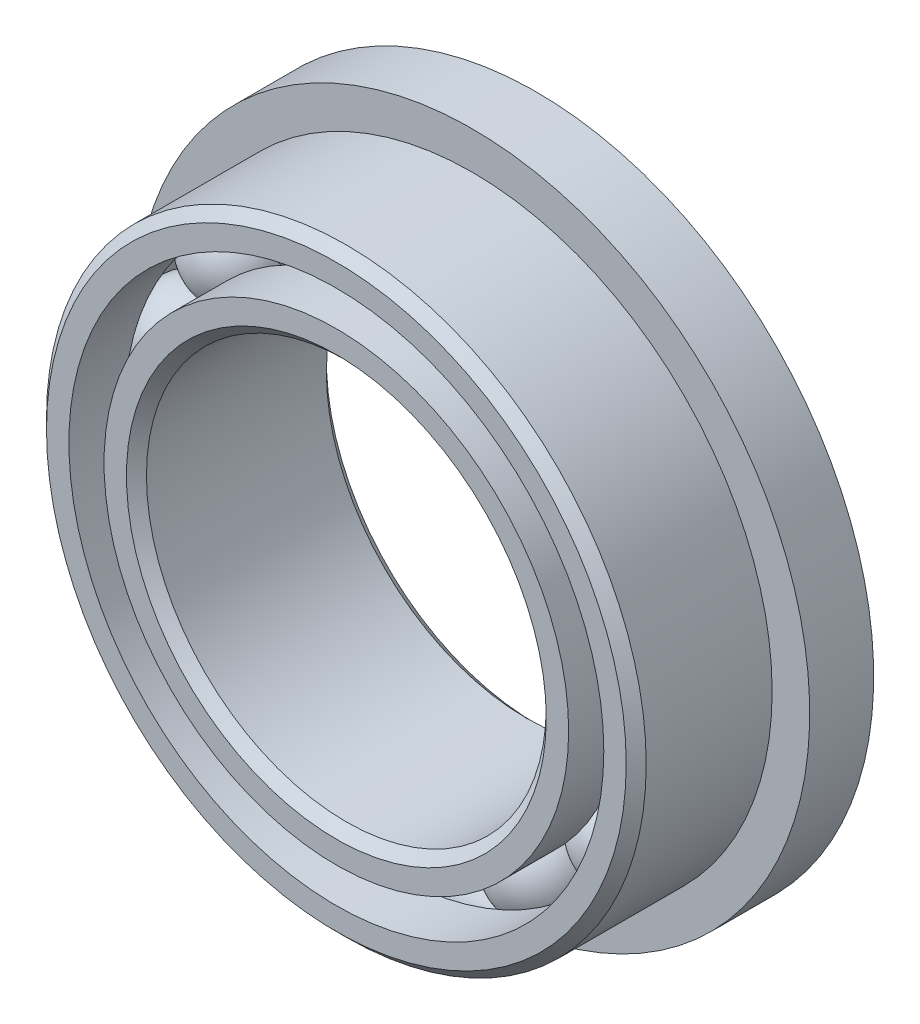
ISO-10303-21;
HEADER;
FILE_DESCRIPTION(('STEP AP214'),'2;1');
FILE_NAME('part.step','',(''),(''),'','','');
FILE_SCHEMA(('AUTOMOTIVE_DESIGN { 1 0 10303 214 1 1 1 1 }'));
ENDSEC;
DATA;
#1=APPLICATION_CONTEXT('core data for automotive mechanical design processes');
#2=APPLICATION_PROTOCOL_DEFINITION('international standard','automotive_design',2000,#1);
#3=PRODUCT_CONTEXT('',#1,'mechanical');
#4=PRODUCT('Part','Part','',(#3));
#5=PRODUCT_RELATED_PRODUCT_CATEGORY('part','',(#4));
#6=PRODUCT_DEFINITION_FORMATION('','',#4);
#7=PRODUCT_DEFINITION_CONTEXT('part definition',#1,'design');
#8=PRODUCT_DEFINITION('design','',#6,#7);
#9=PRODUCT_DEFINITION_SHAPE('','',#8);
#10=(LENGTH_UNIT() NAMED_UNIT(*) SI_UNIT(.MILLI.,.METRE.));
#11=(NAMED_UNIT(*) PLANE_ANGLE_UNIT() SI_UNIT($,.RADIAN.));
#12=(NAMED_UNIT(*) SI_UNIT($,.STERADIAN.) SOLID_ANGLE_UNIT());
#13=UNCERTAINTY_MEASURE_WITH_UNIT(LENGTH_MEASURE(1.E-05),#10,'distance_accuracy_value','');
#14=(GEOMETRIC_REPRESENTATION_CONTEXT(3) GLOBAL_UNCERTAINTY_ASSIGNED_CONTEXT((#13)) GLOBAL_UNIT_ASSIGNED_CONTEXT((#10,
#11,#12)) REPRESENTATION_CONTEXT('',''));
#15=CARTESIAN_POINT('',(0.,0.,0.));
#16=DIRECTION('',(0.,0.,1.));
#17=DIRECTION('',(1.,0.,0.));
#18=AXIS2_PLACEMENT_3D('',#15,#16,#17);
#19=CARTESIAN_POINT('',(-1.72197608962276,3.57572019448775,0.));
#20=DIRECTION('',(0.,0.,1.));
#21=DIRECTION('',(-0.433883739117546,0.900968867902425,0.));
#22=AXIS2_PLACEMENT_3D('',#19,#20,#21);
#23=SPHERICAL_SURFACE('',#22,0.758760243513404);
#24=CARTESIAN_POINT('',(-1.72197608962276,3.57572019448775,0.758760243513404));
#25=VERTEX_POINT('',#24);
#26=VERTEX_LOOP('',#25);
#27=FACE_BOUND('',#26,.T.);
#28=ADVANCED_FACE('F37',(#27),#23,.T.);
#29=CLOSED_SHELL('',(#28));
#30=MANIFOLD_SOLID_BREP('B2',#29);
#31=CARTESIAN_POINT('',(-3.10289369604496,2.47447515112689,0.));
#32=DIRECTION('',(0.,0.,1.));
#33=DIRECTION('',(-0.781831482468022,0.623489801858743,0.));
#34=AXIS2_PLACEMENT_3D('',#31,#32,#33);
#35=SPHERICAL_SURFACE('',#34,0.758760243513404);
#36=CARTESIAN_POINT('',(-3.10289369604496,2.47447515112689,0.758760243513404));
#37=VERTEX_POINT('',#36);
#38=VERTEX_LOOP('',#37);
#39=FACE_BOUND('',#38,.T.);
#40=ADVANCED_FACE('F57',(#39),#35,.T.);
#41=CLOSED_SHELL('',(#40));
#42=MANIFOLD_SOLID_BREP('B6',#41);
#43=CARTESIAN_POINT('',(-3.8692451514716,0.883129956639163,0.));
#44=DIRECTION('',(0.,0.,1.));
#45=DIRECTION('',(-0.974927912181821,0.222520933956325,0.));
#46=AXIS2_PLACEMENT_3D('',#43,#44,#45);
#47=SPHERICAL_SURFACE('',#46,0.758760243513404);
#48=CARTESIAN_POINT('',(-3.8692451514716,0.883129956639163,0.758760243513404));
#49=VERTEX_POINT('',#48);
#50=VERTEX_LOOP('',#49);
#51=FACE_BOUND('',#50,.T.);
#52=ADVANCED_FACE('F77',(#51),#47,.T.);
#53=CLOSED_SHELL('',(#52));
#54=MANIFOLD_SOLID_BREP('B33',#53);
#55=CARTESIAN_POINT('',(-3.86924515147162,-0.883129956639086,0.));
#56=DIRECTION('',(0.,0.,1.));
#57=DIRECTION('',(-0.974927912181826,-0.222520933956305,0.));
#58=AXIS2_PLACEMENT_3D('',#55,#56,#57);
#59=SPHERICAL_SURFACE('',#58,0.758760243513404);
#60=CARTESIAN_POINT('',(-3.86924515147162,-0.883129956639086,0.758760243513404));
#61=VERTEX_POINT('',#60);
#62=VERTEX_LOOP('',#61);
#63=FACE_BOUND('',#62,.T.);
#64=ADVANCED_FACE('F97',(#63),#59,.T.);
#65=CLOSED_SHELL('',(#64));
#66=MANIFOLD_SOLID_BREP('B53',#65);
#67=CARTESIAN_POINT('',(-3.10289369604501,-2.47447515112682,0.));
#68=DIRECTION('',(0.,0.,1.));
#69=DIRECTION('',(-0.781831482468035,-0.623489801858727,0.));
#70=AXIS2_PLACEMENT_3D('',#67,#68,#69);
#71=SPHERICAL_SURFACE('',#70,0.758760243513404);
#72=CARTESIAN_POINT('',(-3.10289369604501,-2.47447515112682,0.758760243513404));
#73=VERTEX_POINT('',#72);
#74=VERTEX_LOOP('',#73);
#75=FACE_BOUND('',#74,.T.);
#76=ADVANCED_FACE('F117',(#75),#71,.T.);
#77=CLOSED_SHELL('',(#76));
#78=MANIFOLD_SOLID_BREP('B73',#77);
#79=CARTESIAN_POINT('',(-1.72197608962284,-3.57572019448771,0.));
#80=DIRECTION('',(0.,0.,1.));
#81=DIRECTION('',(-0.433883739117565,-0.900968867902416,0.));
#82=AXIS2_PLACEMENT_3D('',#79,#80,#81);
#83=SPHERICAL_SURFACE('',#82,0.758760243513404);
#84=CARTESIAN_POINT('',(-1.72197608962284,-3.57572019448771,0.758760243513404));
#85=VERTEX_POINT('',#84);
#86=VERTEX_LOOP('',#85);
#87=FACE_BOUND('',#86,.T.);
#88=ADVANCED_FACE('F137',(#87),#83,.T.);
#89=CLOSED_SHELL('',(#88));
#90=MANIFOLD_SOLID_BREP('B93',#89);
#91=CARTESIAN_POINT('',(0.,-3.96875,0.));
#92=DIRECTION('',(0.,0.,1.));
#93=DIRECTION('',(0.,-1.,0.));
#94=AXIS2_PLACEMENT_3D('',#91,#92,#93);
#95=SPHERICAL_SURFACE('',#94,0.758760243513404);
#96=CARTESIAN_POINT('',(0.,-3.96875,0.758760243513404));
#97=VERTEX_POINT('',#96);
#98=VERTEX_LOOP('',#97);
#99=FACE_BOUND('',#98,.T.);
#100=ADVANCED_FACE('F157',(#99),#95,.T.);
#101=CLOSED_SHELL('',(#100));
#102=MANIFOLD_SOLID_BREP('B113',#101);
#103=CARTESIAN_POINT('',(1.72197608962279,-3.57572019448774,0.));
#104=DIRECTION('',(0.,0.,1.));
#105=DIRECTION('',(0.433883739117553,-0.900968867902422,0.));
#106=AXIS2_PLACEMENT_3D('',#103,#104,#105);
#107=SPHERICAL_SURFACE('',#106,0.758760243513404);
#108=CARTESIAN_POINT('',(1.72197608962279,-3.57572019448774,0.758760243513404));
#109=VERTEX_POINT('',#108);
#110=VERTEX_LOOP('',#109);
#111=FACE_BOUND('',#110,.T.);
#112=ADVANCED_FACE('F177',(#111),#107,.T.);
#113=CLOSED_SHELL('',(#112));
#114=MANIFOLD_SOLID_BREP('B133',#113);
#115=CARTESIAN_POINT('',(3.10289369604498,-2.47447515112686,0.));
#116=DIRECTION('',(0.,0.,1.));
#117=DIRECTION('',(0.781831482468027,-0.623489801858737,0.));
#118=AXIS2_PLACEMENT_3D('',#115,#116,#117);
#119=SPHERICAL_SURFACE('',#118,0.758760243513404);
#120=CARTESIAN_POINT('',(3.10289369604498,-2.47447515112686,0.758760243513404));
#121=VERTEX_POINT('',#120);
#122=VERTEX_LOOP('',#121);
#123=FACE_BOUND('',#122,.T.);
#124=ADVANCED_FACE('F197',(#123),#119,.T.);
#125=CLOSED_SHELL('',(#124));
#126=MANIFOLD_SOLID_BREP('B153',#125);
#127=CARTESIAN_POINT('',(3.86924515147161,-0.883129956639138,0.));
#128=DIRECTION('',(0.,0.,1.));
#129=DIRECTION('',(0.974927912181823,-0.222520933956318,0.));
#130=AXIS2_PLACEMENT_3D('',#127,#128,#129);
#131=SPHERICAL_SURFACE('',#130,0.758760243513404);
#132=CARTESIAN_POINT('',(3.86924515147161,-0.883129956639138,0.758760243513404));
#133=VERTEX_POINT('',#132);
#134=VERTEX_LOOP('',#133);
#135=FACE_BOUND('',#134,.T.);
#136=ADVANCED_FACE('F217',(#135),#131,.T.);
#137=CLOSED_SHELL('',(#136));
#138=MANIFOLD_SOLID_BREP('B173',#137);
#139=CARTESIAN_POINT('',(3.86924515147162,0.883129956639111,0.));
#140=DIRECTION('',(0.,0.,1.));
#141=DIRECTION('',(0.974927912181824,0.222520933956311,0.));
#142=AXIS2_PLACEMENT_3D('',#139,#140,#141);
#143=SPHERICAL_SURFACE('',#142,0.758760243513404);
#144=CARTESIAN_POINT('',(3.86924515147162,0.883129956639111,0.758760243513404));
#145=VERTEX_POINT('',#144);
#146=VERTEX_LOOP('',#145);
#147=FACE_BOUND('',#146,.T.);
#148=ADVANCED_FACE('F237',(#147),#143,.T.);
#149=CLOSED_SHELL('',(#148));
#150=MANIFOLD_SOLID_BREP('B193',#149);
#151=CARTESIAN_POINT('',(3.102893696045,2.47447515112684,0.));
#152=DIRECTION('',(0.,0.,1.));
#153=DIRECTION('',(0.781831482468031,0.623489801858732,0.));
#154=AXIS2_PLACEMENT_3D('',#151,#152,#153);
#155=SPHERICAL_SURFACE('',#154,0.758760243513404);
#156=CARTESIAN_POINT('',(3.102893696045,2.47447515112684,0.758760243513404));
#157=VERTEX_POINT('',#156);
#158=VERTEX_LOOP('',#157);
#159=FACE_BOUND('',#158,.T.);
#160=ADVANCED_FACE('F257',(#159),#155,.T.);
#161=CLOSED_SHELL('',(#160));
#162=MANIFOLD_SOLID_BREP('B213',#161);
#163=CARTESIAN_POINT('',(1.72197608962281,3.57572019448772,0.));
#164=DIRECTION('',(0.,0.,1.));
#165=DIRECTION('',(0.433883739117559,0.900968867902419,0.));
#166=AXIS2_PLACEMENT_3D('',#163,#164,#165);
#167=SPHERICAL_SURFACE('',#166,0.758760243513404);
#168=CARTESIAN_POINT('',(1.72197608962281,3.57572019448772,0.758760243513404));
#169=VERTEX_POINT('',#168);
#170=VERTEX_LOOP('',#169);
#171=FACE_BOUND('',#170,.T.);
#172=ADVANCED_FACE('F277',(#171),#167,.T.);
#173=CLOSED_SHELL('',(#172));
#174=MANIFOLD_SOLID_BREP('B233',#173);
#175=CARTESIAN_POINT('',(0.,3.96875,0.));
#176=DIRECTION('',(0.,0.,1.));
#177=DIRECTION('',(0.,1.,0.));
#178=AXIS2_PLACEMENT_3D('',#175,#176,#177);
#179=SPHERICAL_SURFACE('',#178,0.758760243513404);
#180=CARTESIAN_POINT('',(0.,3.96875,0.758760243513404));
#181=VERTEX_POINT('',#180);
#182=VERTEX_LOOP('',#181);
#183=FACE_BOUND('',#182,.T.);
#184=ADVANCED_FACE('F299',(#183),#179,.T.);
#185=CLOSED_SHELL('',(#184));
#186=MANIFOLD_SOLID_BREP('B253',#185);
#187=CARTESIAN_POINT('',(0.,3.68962912087912,1.5875));
#188=DIRECTION('',(0.,0.,-1.));
#189=DIRECTION('',(-1.,0.,0.));
#190=AXIS2_PLACEMENT_3D('',#187,#188,#189);
#191=PLANE('',#190);
#192=CARTESIAN_POINT('',(0.,0.,1.5875));
#193=DIRECTION('',(0.,0.,1.));
#194=DIRECTION('',(1.,0.,0.));
#195=AXIS2_PLACEMENT_3D('',#192,#193,#194);
#196=CIRCLE('',#195,3.33375);
#197=CARTESIAN_POINT('',(3.33375,0.,1.5875));
#198=VERTEX_POINT('',#197);
#199=EDGE_CURVE('E346',#198,#198,#196,.T.);
#200=ORIENTED_EDGE('',*,*,#199,.F.);
#201=EDGE_LOOP('',(#200));
#202=FACE_BOUND('',#201,.T.);
#203=CARTESIAN_POINT('',(0.,0.,1.5875));
#204=DIRECTION('',(0.,0.,1.));
#205=DIRECTION('',(1.,0.,0.));
#206=AXIS2_PLACEMENT_3D('',#203,#204,#205);
#207=CIRCLE('',#206,3.68962912087912);
#208=CARTESIAN_POINT('',(3.68962912087912,0.,1.5875));
#209=VERTEX_POINT('',#208);
#210=EDGE_CURVE('E298',#209,#209,#207,.T.);
#211=ORIENTED_EDGE('',*,*,#210,.T.);
#212=EDGE_LOOP('',(#211));
#213=FACE_BOUND('',#212,.T.);
#214=ADVANCED_FACE('F318',(#202,#213),#191,.F.);
#215=CARTESIAN_POINT('',(0.,0.,1.5875));
#216=DIRECTION('',(0.,0.,1.));
#217=DIRECTION('',(1.,0.,0.));
#218=AXIS2_PLACEMENT_3D('',#215,#216,#217);
#219=CYLINDRICAL_SURFACE('',#218,3.68962912087912);
#220=ORIENTED_EDGE('',*,*,#210,.F.);
#221=EDGE_LOOP('',(#220));
#222=FACE_BOUND('',#221,.T.);
#223=CARTESIAN_POINT('',(0.,0.,0.705555555555555));
#224=DIRECTION('',(0.,0.,1.));
#225=DIRECTION('',(1.,0.,0.));
#226=AXIS2_PLACEMENT_3D('',#223,#224,#225);
#227=CIRCLE('',#226,3.68962912087912);
#228=CARTESIAN_POINT('',(3.68962912087912,0.,0.705555555555555));
#229=VERTEX_POINT('',#228);
#230=EDGE_CURVE('E324',#229,#229,#227,.T.);
#231=ORIENTED_EDGE('',*,*,#230,.T.);
#232=EDGE_LOOP('',(#231));
#233=FACE_BOUND('',#232,.T.);
#234=ADVANCED_FACE('F353',(#222,#233),#219,.T.);
#235=CARTESIAN_POINT('',(0.,0.,0.));
#236=DIRECTION('',(0.,0.,1.));
#237=DIRECTION('',(1.,0.,0.));
#238=AXIS2_PLACEMENT_3D('',#235,#236,#237);
#239=TOROIDAL_SURFACE('',#238,3.96875,0.758760243513404);
#240=ORIENTED_EDGE('',*,*,#230,.F.);
#241=EDGE_LOOP('',(#240));
#242=FACE_BOUND('',#241,.T.);
#243=CARTESIAN_POINT('',(0.,0.,-0.705555555555556));
#244=DIRECTION('',(0.,0.,1.));
#245=DIRECTION('',(1.,0.,0.));
#246=AXIS2_PLACEMENT_3D('',#243,#244,#245);
#247=CIRCLE('',#246,3.68962912087912);
#248=CARTESIAN_POINT('',(3.68962912087912,0.,-0.705555555555556));
#249=VERTEX_POINT('',#248);
#250=EDGE_CURVE('E328',#249,#249,#247,.T.);
#251=ORIENTED_EDGE('',*,*,#250,.T.);
#252=EDGE_LOOP('',(#251));
#253=FACE_BOUND('',#252,.T.);
#254=ADVANCED_FACE('F357',(#242,#253),#239,.F.);
#255=CARTESIAN_POINT('',(0.,0.,1.5875));
#256=DIRECTION('',(0.,0.,1.));
#257=DIRECTION('',(1.,0.,0.));
#258=AXIS2_PLACEMENT_3D('',#255,#256,#257);
#259=CYLINDRICAL_SURFACE('',#258,3.68962912087912);
#260=ORIENTED_EDGE('',*,*,#250,.F.);
#261=EDGE_LOOP('',(#260));
#262=FACE_BOUND('',#261,.T.);
#263=CARTESIAN_POINT('',(0.,0.,-1.5875));
#264=DIRECTION('',(0.,0.,1.));
#265=DIRECTION('',(1.,0.,0.));
#266=AXIS2_PLACEMENT_3D('',#263,#264,#265);
#267=CIRCLE('',#266,3.68962912087912);
#268=CARTESIAN_POINT('',(3.68962912087912,0.,-1.5875));
#269=VERTEX_POINT('',#268);
#270=EDGE_CURVE('E332',#269,#269,#267,.T.);
#271=ORIENTED_EDGE('',*,*,#270,.T.);
#272=EDGE_LOOP('',(#271));
#273=FACE_BOUND('',#272,.T.);
#274=ADVANCED_FACE('F362',(#262,#273),#259,.T.);
#275=CARTESIAN_POINT('',(0.,3.33375,-1.5875));
#276=DIRECTION('',(0.,0.,1.));
#277=DIRECTION('',(1.,0.,0.));
#278=AXIS2_PLACEMENT_3D('',#275,#276,#277);
#279=PLANE('',#278);
#280=ORIENTED_EDGE('',*,*,#270,.F.);
#281=EDGE_LOOP('',(#280));
#282=FACE_BOUND('',#281,.T.);
#283=CARTESIAN_POINT('',(0.,0.,-1.5875));
#284=DIRECTION('',(0.,0.,1.));
#285=DIRECTION('',(1.,0.,0.));
#286=AXIS2_PLACEMENT_3D('',#283,#284,#285);
#287=CIRCLE('',#286,3.33375);
#288=CARTESIAN_POINT('',(3.33375,0.,-1.5875));
#289=VERTEX_POINT('',#288);
#290=EDGE_CURVE('E337',#289,#289,#287,.T.);
#291=ORIENTED_EDGE('',*,*,#290,.T.);
#292=EDGE_LOOP('',(#291));
#293=FACE_BOUND('',#292,.T.);
#294=ADVANCED_FACE('F368',(#282,#293),#279,.F.);
#295=CARTESIAN_POINT('',(0.,0.,-1.42875));
#296=DIRECTION('',(0.,0.,-1.));
#297=DIRECTION('',(-1.,0.,0.));
#298=AXIS2_PLACEMENT_3D('',#295,#296,#297);
#299=CONICAL_SURFACE('',#298,3.175,0.785398163397446);
#300=ORIENTED_EDGE('',*,*,#290,.F.);
#301=EDGE_LOOP('',(#300));
#302=FACE_BOUND('',#301,.T.);
#303=CARTESIAN_POINT('',(0.,0.,-1.42875));
#304=DIRECTION('',(0.,0.,1.));
#305=DIRECTION('',(1.,0.,0.));
#306=AXIS2_PLACEMENT_3D('',#303,#304,#305);
#307=CIRCLE('',#306,3.175);
#308=CARTESIAN_POINT('',(3.175,0.,-1.42875));
#309=VERTEX_POINT('',#308);
#310=EDGE_CURVE('E340',#309,#309,#307,.T.);
#311=ORIENTED_EDGE('',*,*,#310,.T.);
#312=EDGE_LOOP('',(#311));
#313=FACE_BOUND('',#312,.T.);
#314=ADVANCED_FACE('F372',(#302,#313),#299,.F.);
#315=CARTESIAN_POINT('',(0.,0.,1.5875));
#316=DIRECTION('',(0.,0.,1.));
#317=DIRECTION('',(1.,0.,0.));
#318=AXIS2_PLACEMENT_3D('',#315,#316,#317);
#319=CYLINDRICAL_SURFACE('',#318,3.175);
#320=ORIENTED_EDGE('',*,*,#310,.F.);
#321=EDGE_LOOP('',(#320));
#322=FACE_BOUND('',#321,.T.);
#323=CARTESIAN_POINT('',(0.,0.,1.42875));
#324=DIRECTION('',(0.,0.,1.));
#325=DIRECTION('',(1.,0.,0.));
#326=AXIS2_PLACEMENT_3D('',#323,#324,#325);
#327=CIRCLE('',#326,3.175);
#328=CARTESIAN_POINT('',(3.175,0.,1.42875));
#329=VERTEX_POINT('',#328);
#330=EDGE_CURVE('E343',#329,#329,#327,.T.);
#331=ORIENTED_EDGE('',*,*,#330,.T.);
#332=EDGE_LOOP('',(#331));
#333=FACE_BOUND('',#332,.T.);
#334=ADVANCED_FACE('F376',(#322,#333),#319,.F.);
#335=CARTESIAN_POINT('',(0.,0.,1.5875));
#336=DIRECTION('',(0.,0.,1.));
#337=DIRECTION('',(1.,0.,0.));
#338=AXIS2_PLACEMENT_3D('',#335,#336,#337);
#339=CONICAL_SURFACE('',#338,3.33375,0.785398163397451);
#340=ORIENTED_EDGE('',*,*,#330,.F.);
#341=EDGE_LOOP('',(#340));
#342=FACE_BOUND('',#341,.T.);
#343=ORIENTED_EDGE('',*,*,#199,.T.);
#344=EDGE_LOOP('',(#343));
#345=FACE_BOUND('',#344,.T.);
#346=ADVANCED_FACE('F350',(#342,#345),#339,.F.);
#347=CLOSED_SHELL('',(#214,#234,#254,#274,#294,#314,#334,#346));
#348=MANIFOLD_SOLID_BREP('B273',#347);
#349=CARTESIAN_POINT('',(0.,0.,0.));
#350=DIRECTION('',(0.,0.,1.));
#351=DIRECTION('',(1.,0.,0.));
#352=AXIS2_PLACEMENT_3D('',#349,#350,#351);
#353=TOROIDAL_SURFACE('',#352,3.96875,0.758760243513404);
#354=CARTESIAN_POINT('',(0.,0.,-0.571500000000001));
#355=DIRECTION('',(0.,0.,1.));
#356=DIRECTION('',(1.,0.,0.));
#357=AXIS2_PLACEMENT_3D('',#354,#355,#356);
#358=CIRCLE('',#357,4.46785405441803);
#359=CARTESIAN_POINT('',(4.46785405441803,0.,-0.571500000000001));
#360=VERTEX_POINT('',#359);
#361=EDGE_CURVE('E443',#360,#360,#358,.F.);
#362=ORIENTED_EDGE('',*,*,#361,.T.);
#363=EDGE_LOOP('',(#362));
#364=FACE_BOUND('',#363,.T.);
#365=CARTESIAN_POINT('',(0.,0.,0.705555555555555));
#366=DIRECTION('',(0.,0.,1.));
#367=DIRECTION('',(1.,0.,0.));
#368=AXIS2_PLACEMENT_3D('',#365,#366,#367);
#369=CIRCLE('',#368,4.24787087912088);
#370=CARTESIAN_POINT('',(4.24787087912088,0.,0.705555555555555));
#371=VERTEX_POINT('',#370);
#372=EDGE_CURVE('E480',#371,#371,#369,.T.);
#373=ORIENTED_EDGE('',*,*,#372,.T.);
#374=EDGE_LOOP('',(#373));
#375=FACE_BOUND('',#374,.T.);
#376=ADVANCED_FACE('F439',(#364,#375),#353,.F.);
#377=CARTESIAN_POINT('',(0.,0.,1.42875));
#378=DIRECTION('',(0.,0.,-1.));
#379=DIRECTION('',(-1.,0.,0.));
#380=AXIS2_PLACEMENT_3D('',#377,#378,#379);
#381=CONICAL_SURFACE('',#380,4.7625,0.785398163397446);
#382=CARTESIAN_POINT('',(0.,0.,1.5875));
#383=DIRECTION('',(0.,0.,1.));
#384=DIRECTION('',(1.,0.,0.));
#385=AXIS2_PLACEMENT_3D('',#382,#383,#384);
#386=CIRCLE('',#385,4.60375);
#387=CARTESIAN_POINT('',(4.60375,0.,1.5875));
#388=VERTEX_POINT('',#387);
#389=EDGE_CURVE('E474',#388,#388,#386,.T.);
#390=ORIENTED_EDGE('',*,*,#389,.F.);
#391=EDGE_LOOP('',(#390));
#392=FACE_BOUND('',#391,.T.);
#393=CARTESIAN_POINT('',(0.,0.,1.42875));
#394=DIRECTION('',(0.,0.,1.));
#395=DIRECTION('',(1.,0.,0.));
#396=AXIS2_PLACEMENT_3D('',#393,#394,#395);
#397=CIRCLE('',#396,4.7625);
#398=CARTESIAN_POINT('',(4.7625,0.,1.42875));
#399=VERTEX_POINT('',#398);
#400=EDGE_CURVE('E317',#399,#399,#397,.T.);
#401=ORIENTED_EDGE('',*,*,#400,.T.);
#402=EDGE_LOOP('',(#401));
#403=FACE_BOUND('',#402,.T.);
#404=ADVANCED_FACE('F441',(#392,#403),#381,.T.);
#405=CARTESIAN_POINT('',(0.,0.,1.5875));
#406=DIRECTION('',(0.,0.,1.));
#407=DIRECTION('',(1.,0.,0.));
#408=AXIS2_PLACEMENT_3D('',#405,#406,#407);
#409=CYLINDRICAL_SURFACE('',#408,4.7625);
#410=CARTESIAN_POINT('',(0.,0.,-0.571500000000001));
#411=DIRECTION('',(0.,0.,1.));
#412=DIRECTION('',(1.,0.,0.));
#413=AXIS2_PLACEMENT_3D('',#410,#411,#412);
#414=CIRCLE('',#413,4.7625);
#415=CARTESIAN_POINT('',(4.7625,0.,-0.571500000000001));
#416=VERTEX_POINT('',#415);
#417=EDGE_CURVE('E461',#416,#416,#414,.T.);
#418=ORIENTED_EDGE('',*,*,#417,.T.);
#419=EDGE_LOOP('',(#418));
#420=FACE_BOUND('',#419,.T.);
#421=ORIENTED_EDGE('',*,*,#400,.F.);
#422=EDGE_LOOP('',(#421));
#423=FACE_BOUND('',#422,.T.);
#424=ADVANCED_FACE('F506',(#420,#423),#409,.T.);
#425=CARTESIAN_POINT('',(0.,0.,1.5875));
#426=DIRECTION('',(0.,0.,1.));
#427=DIRECTION('',(1.,0.,0.));
#428=AXIS2_PLACEMENT_3D('',#425,#426,#427);
#429=CYLINDRICAL_SURFACE('',#428,4.24787087912088);
#430=ORIENTED_EDGE('',*,*,#372,.F.);
#431=EDGE_LOOP('',(#430));
#432=FACE_BOUND('',#431,.T.);
#433=CARTESIAN_POINT('',(0.,0.,1.5875));
#434=DIRECTION('',(0.,0.,1.));
#435=DIRECTION('',(1.,0.,0.));
#436=AXIS2_PLACEMENT_3D('',#433,#434,#435);
#437=CIRCLE('',#436,4.24787087912088);
#438=CARTESIAN_POINT('',(4.24787087912088,0.,1.5875));
#439=VERTEX_POINT('',#438);
#440=EDGE_CURVE('E477',#439,#439,#437,.T.);
#441=ORIENTED_EDGE('',*,*,#440,.T.);
#442=EDGE_LOOP('',(#441));
#443=FACE_BOUND('',#442,.T.);
#444=ADVANCED_FACE('F512',(#432,#443),#429,.F.);
#445=CARTESIAN_POINT('',(0.,4.60375,1.5875));
#446=DIRECTION('',(0.,0.,-1.));
#447=DIRECTION('',(-1.,0.,0.));
#448=AXIS2_PLACEMENT_3D('',#445,#446,#447);
#449=PLANE('',#448);
#450=ORIENTED_EDGE('',*,*,#440,.F.);
#451=EDGE_LOOP('',(#450));
#452=FACE_BOUND('',#451,.T.);
#453=ORIENTED_EDGE('',*,*,#389,.T.);
#454=EDGE_LOOP('',(#453));
#455=FACE_BOUND('',#454,.T.);
#456=ADVANCED_FACE('F515',(#452,#455),#449,.F.);
#457=CARTESIAN_POINT('',(0.,0.,-1.5875));
#458=DIRECTION('',(0.,0.,-1.));
#459=DIRECTION('',(-1.,0.,0.));
#460=AXIS2_PLACEMENT_3D('',#457,#458,#459);
#461=CYLINDRICAL_SURFACE('',#460,4.42581043956044);
#462=CARTESIAN_POINT('',(0.,0.,-0.571500000000001));
#463=DIRECTION('',(0.,0.,-1.));
#464=DIRECTION('',(-1.,0.,0.));
#465=AXIS2_PLACEMENT_3D('',#462,#463,#464);
#466=CIRCLE('',#465,4.42581043956044);
#467=CARTESIAN_POINT('',(-4.42581043956044,0.,-0.571500000000001));
#468=VERTEX_POINT('',#467);
#469=EDGE_CURVE('E468',#468,#468,#466,.T.);
#470=ORIENTED_EDGE('',*,*,#469,.F.);
#471=EDGE_LOOP('',(#470));
#472=FACE_BOUND('',#471,.T.);
#473=CARTESIAN_POINT('',(0.,0.,-0.605650775385733));
#474=DIRECTION('',(0.,0.,1.));
#475=DIRECTION('',(1.,0.,0.));
#476=AXIS2_PLACEMENT_3D('',#473,#474,#475);
#477=CIRCLE('',#476,4.42581043956044);
#478=CARTESIAN_POINT('',(4.42581043956044,0.,-0.605650775385733));
#479=VERTEX_POINT('',#478);
#480=EDGE_CURVE('E455',#479,#479,#477,.T.);
#481=ORIENTED_EDGE('',*,*,#480,.F.);
#482=EDGE_LOOP('',(#481));
#483=FACE_BOUND('',#482,.T.);
#484=ADVANCED_FACE('F520',(#472,#483),#461,.F.);
#485=CARTESIAN_POINT('',(0.,4.42581043956044,-0.571500000000001));
#486=DIRECTION('',(0.,0.,1.));
#487=DIRECTION('',(1.,0.,0.));
#488=AXIS2_PLACEMENT_3D('',#485,#486,#487);
#489=PLANE('',#488);
#490=ORIENTED_EDGE('',*,*,#469,.T.);
#491=EDGE_LOOP('',(#490));
#492=FACE_BOUND('',#491,.T.);
#493=ORIENTED_EDGE('',*,*,#361,.F.);
#494=EDGE_LOOP('',(#493));
#495=FACE_BOUND('',#494,.T.);
#496=ADVANCED_FACE('F526',(#492,#495),#489,.T.);
#497=CARTESIAN_POINT('',(0.,0.,-0.571500000000001));
#498=DIRECTION('',(0.,0.,-1.));
#499=DIRECTION('',(-1.,0.,0.));
#500=AXIS2_PLACEMENT_3D('',#497,#498,#499);
#501=CIRCLE('',#500,5.3594);
#502=CARTESIAN_POINT('',(-5.3594,0.,-0.571500000000001));
#503=VERTEX_POINT('',#502);
#504=EDGE_CURVE('E463',#503,#503,#501,.T.);
#505=ORIENTED_EDGE('',*,*,#504,.F.);
#506=EDGE_LOOP('',(#505));
#507=FACE_BOUND('',#506,.T.);
#508=ORIENTED_EDGE('',*,*,#417,.F.);
#509=EDGE_LOOP('',(#508));
#510=FACE_BOUND('',#509,.T.);
#511=ADVANCED_FACE('F532',(#507,#510),#489,.T.);
#512=CARTESIAN_POINT('',(0.,0.,-1.5875));
#513=DIRECTION('',(0.,0.,-1.));
#514=DIRECTION('',(-1.,0.,0.));
#515=AXIS2_PLACEMENT_3D('',#512,#513,#514);
#516=CYLINDRICAL_SURFACE('',#515,5.3594);
#517=ORIENTED_EDGE('',*,*,#504,.T.);
#518=EDGE_LOOP('',(#517));
#519=FACE_BOUND('',#518,.T.);
#520=CARTESIAN_POINT('',(0.,0.,-1.5875));
#521=DIRECTION('',(0.,0.,-1.));
#522=DIRECTION('',(-1.,0.,0.));
#523=AXIS2_PLACEMENT_3D('',#520,#521,#522);
#524=CIRCLE('',#523,5.3594);
#525=CARTESIAN_POINT('',(-5.3594,0.,-1.5875));
#526=VERTEX_POINT('',#525);
#527=EDGE_CURVE('E457',#526,#526,#524,.T.);
#528=ORIENTED_EDGE('',*,*,#527,.F.);
#529=EDGE_LOOP('',(#528));
#530=FACE_BOUND('',#529,.T.);
#531=ADVANCED_FACE('F497',(#519,#530),#516,.T.);
#532=CARTESIAN_POINT('',(0.,0.,1.5875));
#533=DIRECTION('',(0.,0.,1.));
#534=DIRECTION('',(1.,0.,0.));
#535=AXIS2_PLACEMENT_3D('',#532,#533,#534);
#536=CYLINDRICAL_SURFACE('',#535,4.24787087912088);
#537=CARTESIAN_POINT('',(0.,0.,-1.5875));
#538=DIRECTION('',(0.,0.,1.));
#539=DIRECTION('',(1.,0.,0.));
#540=AXIS2_PLACEMENT_3D('',#537,#538,#539);
#541=CIRCLE('',#540,4.24787087912088);
#542=CARTESIAN_POINT('',(4.24787087912088,0.,-1.5875));
#543=VERTEX_POINT('',#542);
#544=EDGE_CURVE('E447',#543,#543,#541,.T.);
#545=ORIENTED_EDGE('',*,*,#544,.F.);
#546=EDGE_LOOP('',(#545));
#547=FACE_BOUND('',#546,.T.);
#548=CARTESIAN_POINT('',(0.,0.,-0.705555555555556));
#549=DIRECTION('',(0.,0.,1.));
#550=DIRECTION('',(1.,0.,0.));
#551=AXIS2_PLACEMENT_3D('',#548,#549,#550);
#552=CIRCLE('',#551,4.24787087912088);
#553=CARTESIAN_POINT('',(4.24787087912088,0.,-0.705555555555556));
#554=VERTEX_POINT('',#553);
#555=EDGE_CURVE('E452',#554,#554,#552,.T.);
#556=ORIENTED_EDGE('',*,*,#555,.T.);
#557=EDGE_LOOP('',(#556));
#558=FACE_BOUND('',#557,.T.);
#559=ADVANCED_FACE('F485',(#547,#558),#536,.F.);
#560=ORIENTED_EDGE('',*,*,#480,.T.);
#561=EDGE_LOOP('',(#560));
#562=FACE_BOUND('',#561,.T.);
#563=ORIENTED_EDGE('',*,*,#555,.F.);
#564=EDGE_LOOP('',(#563));
#565=FACE_BOUND('',#564,.T.);
#566=ADVANCED_FACE('F487',(#562,#565),#353,.F.);
#567=CARTESIAN_POINT('',(0.,4.60375,-1.5875));
#568=DIRECTION('',(0.,0.,1.));
#569=DIRECTION('',(1.,0.,0.));
#570=AXIS2_PLACEMENT_3D('',#567,#568,#569);
#571=PLANE('',#570);
#572=ORIENTED_EDGE('',*,*,#544,.T.);
#573=EDGE_LOOP('',(#572));
#574=FACE_BOUND('',#573,.T.);
#575=ORIENTED_EDGE('',*,*,#527,.T.);
#576=EDGE_LOOP('',(#575));
#577=FACE_BOUND('',#576,.T.);
#578=ADVANCED_FACE('F489',(#574,#577),#571,.F.);
#579=CLOSED_SHELL('',(#376,#404,#424,#444,#456,#484,#496,#511,#531,#559,#566,#578));
#580=MANIFOLD_SOLID_BREP('B293',#579);
#581=ADVANCED_BREP_SHAPE_REPRESENTATION('',(#18,#30,#42,#54,#66,#78,#90,#102,#114,#126,#138,
#150,#162,#174,#186,#348,#580),#14);
#582=SHAPE_DEFINITION_REPRESENTATION(#9,#581);
ENDSEC;
END-ISO-10303-21;
